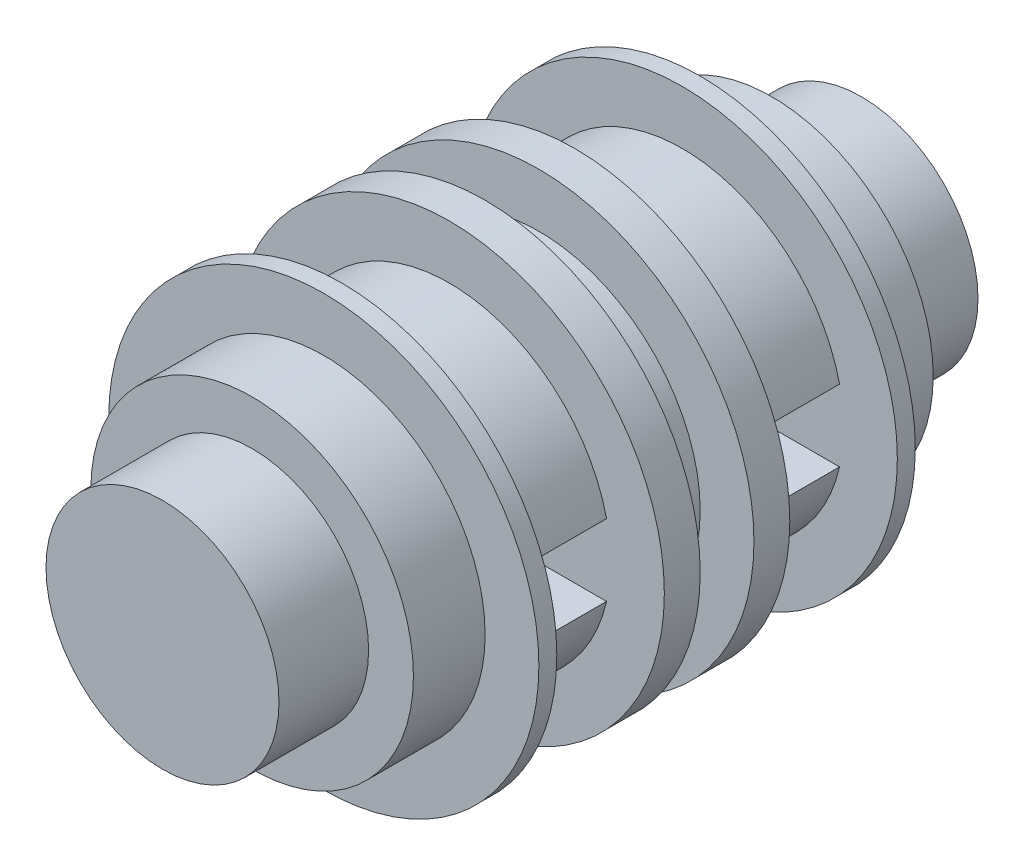
ISO-10303-21;
HEADER;
FILE_DESCRIPTION(('STEP AP214'),'2;1');
FILE_NAME('part.step','',(''),(''),'','','');
FILE_SCHEMA(('AUTOMOTIVE_DESIGN { 1 0 10303 214 1 1 1 1 }'));
ENDSEC;
DATA;
#1=APPLICATION_CONTEXT('core data for automotive mechanical design processes');
#2=APPLICATION_PROTOCOL_DEFINITION('international standard','automotive_design',2000,#1);
#3=PRODUCT_CONTEXT('',#1,'mechanical');
#4=PRODUCT('Part','Part','',(#3));
#5=PRODUCT_RELATED_PRODUCT_CATEGORY('part','',(#4));
#6=PRODUCT_DEFINITION_FORMATION('','',#4);
#7=PRODUCT_DEFINITION_CONTEXT('part definition',#1,'design');
#8=PRODUCT_DEFINITION('design','',#6,#7);
#9=PRODUCT_DEFINITION_SHAPE('','',#8);
#10=(LENGTH_UNIT() NAMED_UNIT(*) SI_UNIT(.MILLI.,.METRE.));
#11=(NAMED_UNIT(*) PLANE_ANGLE_UNIT() SI_UNIT($,.RADIAN.));
#12=(NAMED_UNIT(*) SI_UNIT($,.STERADIAN.) SOLID_ANGLE_UNIT());
#13=UNCERTAINTY_MEASURE_WITH_UNIT(LENGTH_MEASURE(1.E-05),#10,'distance_accuracy_value','');
#14=(GEOMETRIC_REPRESENTATION_CONTEXT(3) GLOBAL_UNCERTAINTY_ASSIGNED_CONTEXT((#13)) GLOBAL_UNIT_ASSIGNED_CONTEXT((#10,
#11,#12)) REPRESENTATION_CONTEXT('',''));
#15=CARTESIAN_POINT('',(0.,0.,0.));
#16=DIRECTION('',(0.,0.,1.));
#17=DIRECTION('',(1.,0.,0.));
#18=AXIS2_PLACEMENT_3D('',#15,#16,#17);
#19=CARTESIAN_POINT('',(0.,0.,-6.5));
#20=DIRECTION('',(0.,0.,1.));
#21=DIRECTION('',(1.,0.,0.));
#22=AXIS2_PLACEMENT_3D('',#19,#20,#21);
#23=CYLINDRICAL_SURFACE('',#22,4.5);
#24=CARTESIAN_POINT('',(0.,0.,-6.5));
#25=DIRECTION('',(0.,0.,1.));
#26=DIRECTION('',(1.,0.,0.));
#27=AXIS2_PLACEMENT_3D('',#24,#25,#26);
#28=CIRCLE('',#27,4.5);
#29=CARTESIAN_POINT('',(4.38748219369606,1.,-6.5));
#30=VERTEX_POINT('',#29);
#31=CARTESIAN_POINT('',(-4.38748219369606,1.,-6.5));
#32=VERTEX_POINT('',#31);
#33=EDGE_CURVE('E112',#30,#32,#28,.T.);
#34=ORIENTED_EDGE('',*,*,#33,.T.);
#35=DIRECTION('',(0.,0.,1.));
#36=VECTOR('',#35,1.);
#37=CARTESIAN_POINT('',(-4.38748219369606,1.,-6.5));
#38=LINE('',#37,#36);
#39=CARTESIAN_POINT('',(-4.38748219369606,1.,-3.5));
#40=VERTEX_POINT('',#39);
#41=EDGE_CURVE('E12',#32,#40,#38,.T.);
#42=ORIENTED_EDGE('',*,*,#41,.T.);
#43=CARTESIAN_POINT('',(0.,0.,-3.5));
#44=DIRECTION('',(0.,0.,-1.));
#45=DIRECTION('',(-1.,0.,0.));
#46=AXIS2_PLACEMENT_3D('',#43,#44,#45);
#47=CIRCLE('',#46,4.5);
#48=CARTESIAN_POINT('',(4.38748219369606,1.,-3.5));
#49=VERTEX_POINT('',#48);
#50=EDGE_CURVE('E190',#40,#49,#47,.T.);
#51=ORIENTED_EDGE('',*,*,#50,.T.);
#52=DIRECTION('',(0.,0.,1.));
#53=VECTOR('',#52,1.);
#54=CARTESIAN_POINT('',(4.38748219369606,1.,-6.5));
#55=LINE('',#54,#53);
#56=EDGE_CURVE('E51',#49,#30,#55,.F.);
#57=ORIENTED_EDGE('',*,*,#56,.T.);
#58=EDGE_LOOP('',(#34,#42,#51,#57));
#59=FACE_BOUND('',#58,.T.);
#60=ADVANCED_FACE('F43',(#59),#23,.T.);
#61=CARTESIAN_POINT('',(-4.38748219369606,-1.,-6.5));
#62=VERTEX_POINT('',#61);
#63=CARTESIAN_POINT('',(4.38748219369606,-1.,-6.5));
#64=VERTEX_POINT('',#63);
#65=EDGE_CURVE('E124',#62,#64,#28,.T.);
#66=ORIENTED_EDGE('',*,*,#65,.T.);
#67=DIRECTION('',(0.,0.,1.));
#68=VECTOR('',#67,1.);
#69=CARTESIAN_POINT('',(4.38748219369606,-1.,-6.5));
#70=LINE('',#69,#68);
#71=CARTESIAN_POINT('',(4.38748219369606,-1.,-3.5));
#72=VERTEX_POINT('',#71);
#73=EDGE_CURVE('E217',#64,#72,#70,.T.);
#74=ORIENTED_EDGE('',*,*,#73,.T.);
#75=CARTESIAN_POINT('',(-4.38748219369606,-1.,-3.5));
#76=VERTEX_POINT('',#75);
#77=EDGE_CURVE('E191',#72,#76,#47,.T.);
#78=ORIENTED_EDGE('',*,*,#77,.T.);
#79=DIRECTION('',(0.,0.,1.));
#80=VECTOR('',#79,1.);
#81=CARTESIAN_POINT('',(-4.38748219369606,-1.,-6.5));
#82=LINE('',#81,#80);
#83=EDGE_CURVE('E189',#76,#62,#82,.F.);
#84=ORIENTED_EDGE('',*,*,#83,.T.);
#85=EDGE_LOOP('',(#66,#74,#78,#84));
#86=FACE_BOUND('',#85,.T.);
#87=ADVANCED_FACE('F222',(#86),#23,.T.);
#88=CARTESIAN_POINT('',(0.,0.,3.));
#89=DIRECTION('',(0.,0.,-1.));
#90=DIRECTION('',(-1.,0.,0.));
#91=AXIS2_PLACEMENT_3D('',#88,#89,#90);
#92=CYLINDRICAL_SURFACE('',#91,4.5);
#93=CARTESIAN_POINT('',(0.,0.,3.));
#94=DIRECTION('',(0.,0.,1.));
#95=DIRECTION('',(1.,0.,0.));
#96=AXIS2_PLACEMENT_3D('',#93,#94,#95);
#97=CIRCLE('',#96,4.5);
#98=CARTESIAN_POINT('',(4.38748219369606,1.,3.));
#99=VERTEX_POINT('',#98);
#100=CARTESIAN_POINT('',(-4.38748219369606,1.,3.));
#101=VERTEX_POINT('',#100);
#102=EDGE_CURVE('E136',#99,#101,#97,.T.);
#103=ORIENTED_EDGE('',*,*,#102,.F.);
#104=DIRECTION('',(0.,0.,-1.));
#105=VECTOR('',#104,1.);
#106=CARTESIAN_POINT('',(4.38748219369606,1.,3.));
#107=LINE('',#106,#105);
#108=CARTESIAN_POINT('',(4.38748219369606,1.,0.));
#109=VERTEX_POINT('',#108);
#110=EDGE_CURVE('E167',#99,#109,#107,.T.);
#111=ORIENTED_EDGE('',*,*,#110,.T.);
#112=CARTESIAN_POINT('',(0.,0.,0.));
#113=DIRECTION('',(0.,0.,1.));
#114=DIRECTION('',(1.,0.,0.));
#115=AXIS2_PLACEMENT_3D('',#112,#113,#114);
#116=CIRCLE('',#115,4.5);
#117=CARTESIAN_POINT('',(-4.38748219369606,1.,0.));
#118=VERTEX_POINT('',#117);
#119=EDGE_CURVE('E206',#109,#118,#116,.T.);
#120=ORIENTED_EDGE('',*,*,#119,.T.);
#121=DIRECTION('',(0.,0.,-1.));
#122=VECTOR('',#121,1.);
#123=CARTESIAN_POINT('',(-4.38748219369606,1.,3.));
#124=LINE('',#123,#122);
#125=EDGE_CURVE('E164',#118,#101,#124,.F.);
#126=ORIENTED_EDGE('',*,*,#125,.T.);
#127=EDGE_LOOP('',(#103,#111,#120,#126));
#128=FACE_BOUND('',#127,.T.);
#129=ADVANCED_FACE('F249',(#128),#92,.T.);
#130=CARTESIAN_POINT('',(-4.38748219369606,-1.,3.));
#131=VERTEX_POINT('',#130);
#132=CARTESIAN_POINT('',(4.38748219369606,-1.,3.));
#133=VERTEX_POINT('',#132);
#134=EDGE_CURVE('E140',#131,#133,#97,.T.);
#135=ORIENTED_EDGE('',*,*,#134,.F.);
#136=DIRECTION('',(0.,0.,-1.));
#137=VECTOR('',#136,1.);
#138=CARTESIAN_POINT('',(-4.38748219369606,-1.,3.));
#139=LINE('',#138,#137);
#140=CARTESIAN_POINT('',(-4.38748219369606,-1.,0.));
#141=VERTEX_POINT('',#140);
#142=EDGE_CURVE('E162',#131,#141,#139,.T.);
#143=ORIENTED_EDGE('',*,*,#142,.T.);
#144=CARTESIAN_POINT('',(4.38748219369606,-1.,0.));
#145=VERTEX_POINT('',#144);
#146=EDGE_CURVE('E210',#141,#145,#116,.T.);
#147=ORIENTED_EDGE('',*,*,#146,.T.);
#148=DIRECTION('',(0.,0.,-1.));
#149=VECTOR('',#148,1.);
#150=CARTESIAN_POINT('',(4.38748219369606,-1.,3.));
#151=LINE('',#150,#149);
#152=EDGE_CURVE('E115',#145,#133,#151,.F.);
#153=ORIENTED_EDGE('',*,*,#152,.T.);
#154=EDGE_LOOP('',(#135,#143,#147,#153));
#155=FACE_BOUND('',#154,.T.);
#156=ADVANCED_FACE('F280',(#155),#92,.T.);
#157=CARTESIAN_POINT('',(0.,0.,-1.));
#158=DIRECTION('',(0.,0.,1.));
#159=DIRECTION('',(1.,0.,0.));
#160=AXIS2_PLACEMENT_3D('',#157,#158,#159);
#161=CYLINDRICAL_SURFACE('',#160,6.);
#162=CARTESIAN_POINT('',(0.,0.,-1.));
#163=DIRECTION('',(0.,0.,-1.));
#164=DIRECTION('',(-1.,0.,0.));
#165=AXIS2_PLACEMENT_3D('',#162,#163,#164);
#166=CIRCLE('',#165,6.);
#167=CARTESIAN_POINT('',(-6.,0.,-1.));
#168=VERTEX_POINT('',#167);
#169=EDGE_CURVE('E207',#168,#168,#166,.T.);
#170=ORIENTED_EDGE('',*,*,#169,.F.);
#171=EDGE_LOOP('',(#170));
#172=FACE_BOUND('',#171,.T.);
#173=CARTESIAN_POINT('',(0.,0.,0.));
#174=DIRECTION('',(0.,0.,-1.));
#175=DIRECTION('',(-1.,0.,0.));
#176=AXIS2_PLACEMENT_3D('',#173,#174,#175);
#177=CIRCLE('',#176,6.);
#178=CARTESIAN_POINT('',(-6.,0.,0.));
#179=VERTEX_POINT('',#178);
#180=EDGE_CURVE('E203',#179,#179,#177,.T.);
#181=ORIENTED_EDGE('',*,*,#180,.T.);
#182=EDGE_LOOP('',(#181));
#183=FACE_BOUND('',#182,.T.);
#184=ADVANCED_FACE('F396',(#172,#183),#161,.T.);
#185=CARTESIAN_POINT('',(0.,0.,-1.));
#186=DIRECTION('',(0.,0.,-1.));
#187=DIRECTION('',(-1.,0.,0.));
#188=AXIS2_PLACEMENT_3D('',#185,#186,#187);
#189=PLANE('',#188);
#190=CARTESIAN_POINT('',(0.,0.,-1.));
#191=DIRECTION('',(0.,0.,-1.));
#192=DIRECTION('',(-1.,0.,0.));
#193=AXIS2_PLACEMENT_3D('',#190,#191,#192);
#194=CIRCLE('',#193,4.5);
#195=CARTESIAN_POINT('',(-4.5,0.,-1.));
#196=VERTEX_POINT('',#195);
#197=EDGE_CURVE('E194',#196,#196,#194,.T.);
#198=ORIENTED_EDGE('',*,*,#197,.F.);
#199=EDGE_LOOP('',(#198));
#200=FACE_BOUND('',#199,.T.);
#201=ORIENTED_EDGE('',*,*,#169,.T.);
#202=EDGE_LOOP('',(#201));
#203=FACE_BOUND('',#202,.T.);
#204=ADVANCED_FACE('F471',(#200,#203),#189,.T.);
#205=CARTESIAN_POINT('',(0.,0.,0.));
#206=DIRECTION('',(0.,0.,-1.));
#207=DIRECTION('',(-1.,0.,0.));
#208=AXIS2_PLACEMENT_3D('',#205,#206,#207);
#209=PLANE('',#208);
#210=ORIENTED_EDGE('',*,*,#119,.F.);
#211=DIRECTION('',(-1.,0.,0.));
#212=VECTOR('',#211,1.);
#213=CARTESIAN_POINT('',(25.45,1.,0.));
#214=LINE('',#213,#212);
#215=EDGE_CURVE('E146',#109,#118,#214,.T.);
#216=ORIENTED_EDGE('',*,*,#215,.T.);
#217=EDGE_LOOP('',(#210,#216));
#218=FACE_BOUND('',#217,.T.);
#219=DIRECTION('',(-1.,0.,0.));
#220=VECTOR('',#219,1.);
#221=CARTESIAN_POINT('',(25.45,-1.,0.));
#222=LINE('',#221,#220);
#223=EDGE_CURVE('E63',#145,#141,#222,.T.);
#224=ORIENTED_EDGE('',*,*,#223,.F.);
#225=ORIENTED_EDGE('',*,*,#146,.F.);
#226=EDGE_LOOP('',(#224,#225));
#227=FACE_BOUND('',#226,.T.);
#228=ORIENTED_EDGE('',*,*,#180,.F.);
#229=EDGE_LOOP('',(#228));
#230=FACE_BOUND('',#229,.T.);
#231=ADVANCED_FACE('F460',(#218,#227,#230),#209,.F.);
#232=CARTESIAN_POINT('',(0.,0.,-2.5));
#233=DIRECTION('',(0.,0.,1.));
#234=DIRECTION('',(1.,0.,0.));
#235=AXIS2_PLACEMENT_3D('',#232,#233,#234);
#236=CYLINDRICAL_SURFACE('',#235,4.5);
#237=CARTESIAN_POINT('',(0.,0.,-2.5));
#238=DIRECTION('',(0.,0.,-1.));
#239=DIRECTION('',(-1.,0.,0.));
#240=AXIS2_PLACEMENT_3D('',#237,#238,#239);
#241=CIRCLE('',#240,4.5);
#242=CARTESIAN_POINT('',(-4.5,0.,-2.5));
#243=VERTEX_POINT('',#242);
#244=EDGE_CURVE('E198',#243,#243,#241,.T.);
#245=ORIENTED_EDGE('',*,*,#244,.F.);
#246=EDGE_LOOP('',(#245));
#247=FACE_BOUND('',#246,.T.);
#248=ORIENTED_EDGE('',*,*,#197,.T.);
#249=EDGE_LOOP('',(#248));
#250=FACE_BOUND('',#249,.T.);
#251=ADVANCED_FACE('F450',(#247,#250),#236,.T.);
#252=CARTESIAN_POINT('',(0.,0.,-3.5));
#253=DIRECTION('',(0.,0.,1.));
#254=DIRECTION('',(1.,0.,0.));
#255=AXIS2_PLACEMENT_3D('',#252,#253,#254);
#256=CYLINDRICAL_SURFACE('',#255,6.);
#257=CARTESIAN_POINT('',(0.,0.,-3.5));
#258=DIRECTION('',(0.,0.,-1.));
#259=DIRECTION('',(-1.,0.,0.));
#260=AXIS2_PLACEMENT_3D('',#257,#258,#259);
#261=CIRCLE('',#260,6.);
#262=CARTESIAN_POINT('',(-6.,0.,-3.5));
#263=VERTEX_POINT('',#262);
#264=EDGE_CURVE('E195',#263,#263,#261,.T.);
#265=ORIENTED_EDGE('',*,*,#264,.F.);
#266=EDGE_LOOP('',(#265));
#267=FACE_BOUND('',#266,.T.);
#268=CARTESIAN_POINT('',(0.,0.,-2.5));
#269=DIRECTION('',(0.,0.,-1.));
#270=DIRECTION('',(-1.,0.,0.));
#271=AXIS2_PLACEMENT_3D('',#268,#269,#270);
#272=CIRCLE('',#271,6.);
#273=CARTESIAN_POINT('',(-6.,0.,-2.5));
#274=VERTEX_POINT('',#273);
#275=EDGE_CURVE('E185',#274,#274,#272,.T.);
#276=ORIENTED_EDGE('',*,*,#275,.T.);
#277=EDGE_LOOP('',(#276));
#278=FACE_BOUND('',#277,.T.);
#279=ADVANCED_FACE('F434',(#267,#278),#256,.T.);
#280=CARTESIAN_POINT('',(0.,0.,-3.5));
#281=DIRECTION('',(0.,0.,-1.));
#282=DIRECTION('',(-1.,0.,0.));
#283=AXIS2_PLACEMENT_3D('',#280,#281,#282);
#284=PLANE('',#283);
#285=ORIENTED_EDGE('',*,*,#50,.F.);
#286=DIRECTION('',(-1.,0.,0.));
#287=VECTOR('',#286,1.);
#288=CARTESIAN_POINT('',(25.45,1.,-3.5));
#289=LINE('',#288,#287);
#290=EDGE_CURVE('E116',#49,#40,#289,.T.);
#291=ORIENTED_EDGE('',*,*,#290,.F.);
#292=EDGE_LOOP('',(#285,#291));
#293=FACE_BOUND('',#292,.T.);
#294=ORIENTED_EDGE('',*,*,#264,.T.);
#295=EDGE_LOOP('',(#294));
#296=FACE_BOUND('',#295,.T.);
#297=ORIENTED_EDGE('',*,*,#77,.F.);
#298=DIRECTION('',(-1.,0.,0.));
#299=VECTOR('',#298,1.);
#300=CARTESIAN_POINT('',(25.45,-1.,-3.5));
#301=LINE('',#300,#299);
#302=EDGE_CURVE('E150',#72,#76,#301,.T.);
#303=ORIENTED_EDGE('',*,*,#302,.T.);
#304=EDGE_LOOP('',(#297,#303));
#305=FACE_BOUND('',#304,.T.);
#306=ADVANCED_FACE('F227',(#293,#296,#305),#284,.T.);
#307=CARTESIAN_POINT('',(0.,0.,-2.5));
#308=DIRECTION('',(0.,0.,-1.));
#309=DIRECTION('',(-1.,0.,0.));
#310=AXIS2_PLACEMENT_3D('',#307,#308,#309);
#311=PLANE('',#310);
#312=ORIENTED_EDGE('',*,*,#244,.T.);
#313=EDGE_LOOP('',(#312));
#314=FACE_BOUND('',#313,.T.);
#315=ORIENTED_EDGE('',*,*,#275,.F.);
#316=EDGE_LOOP('',(#315));
#317=FACE_BOUND('',#316,.T.);
#318=ADVANCED_FACE('F231',(#314,#317),#311,.F.);
#319=CARTESIAN_POINT('',(25.45,-1.,-6.5));
#320=DIRECTION('',(0.,0.,-1.));
#321=DIRECTION('',(-1.,0.,0.));
#322=AXIS2_PLACEMENT_3D('',#319,#320,#321);
#323=PLANE('',#322);
#324=DIRECTION('',(-1.,0.,0.));
#325=VECTOR('',#324,1.);
#326=CARTESIAN_POINT('',(25.45,-1.,-6.5));
#327=LINE('',#326,#325);
#328=EDGE_CURVE('E153',#64,#62,#327,.T.);
#329=ORIENTED_EDGE('',*,*,#328,.F.);
#330=ORIENTED_EDGE('',*,*,#65,.F.);
#331=EDGE_LOOP('',(#329,#330));
#332=FACE_BOUND('',#331,.T.);
#333=DIRECTION('',(-1.,0.,0.));
#334=VECTOR('',#333,1.);
#335=CARTESIAN_POINT('',(25.45,1.,-6.5));
#336=LINE('',#335,#334);
#337=EDGE_CURVE('E107',#30,#32,#336,.T.);
#338=ORIENTED_EDGE('',*,*,#337,.T.);
#339=ORIENTED_EDGE('',*,*,#33,.F.);
#340=EDGE_LOOP('',(#338,#339));
#341=FACE_BOUND('',#340,.T.);
#342=CARTESIAN_POINT('',(0.,0.,-6.5));
#343=DIRECTION('',(0.,0.,1.));
#344=DIRECTION('',(1.,0.,0.));
#345=AXIS2_PLACEMENT_3D('',#342,#343,#344);
#346=CIRCLE('',#345,6.);
#347=CARTESIAN_POINT('',(6.,0.,-6.5));
#348=VERTEX_POINT('',#347);
#349=EDGE_CURVE('E127',#348,#348,#346,.T.);
#350=ORIENTED_EDGE('',*,*,#349,.T.);
#351=EDGE_LOOP('',(#350));
#352=FACE_BOUND('',#351,.T.);
#353=ADVANCED_FACE('F109',(#332,#341,#352),#323,.F.);
#354=CARTESIAN_POINT('',(25.45,1.,-6.5));
#355=DIRECTION('',(0.,1.,0.));
#356=DIRECTION('',(0.,0.,1.));
#357=AXIS2_PLACEMENT_3D('',#354,#355,#356);
#358=PLANE('',#357);
#359=ORIENTED_EDGE('',*,*,#337,.F.);
#360=ORIENTED_EDGE('',*,*,#56,.F.);
#361=ORIENTED_EDGE('',*,*,#290,.T.);
#362=ORIENTED_EDGE('',*,*,#41,.F.);
#363=EDGE_LOOP('',(#359,#360,#361,#362));
#364=FACE_BOUND('',#363,.T.);
#365=ADVANCED_FACE('F118',(#364),#358,.F.);
#366=CARTESIAN_POINT('',(25.45,-1.,-6.5));
#367=DIRECTION('',(0.,-1.,0.));
#368=DIRECTION('',(0.,0.,-1.));
#369=AXIS2_PLACEMENT_3D('',#366,#367,#368);
#370=PLANE('',#369);
#371=ORIENTED_EDGE('',*,*,#328,.T.);
#372=ORIENTED_EDGE('',*,*,#83,.F.);
#373=ORIENTED_EDGE('',*,*,#302,.F.);
#374=ORIENTED_EDGE('',*,*,#73,.F.);
#375=EDGE_LOOP('',(#371,#372,#373,#374));
#376=FACE_BOUND('',#375,.T.);
#377=ADVANCED_FACE('F228',(#376),#370,.F.);
#378=CARTESIAN_POINT('',(25.45,-1.,3.));
#379=DIRECTION('',(0.,0.,1.));
#380=DIRECTION('',(1.,0.,0.));
#381=AXIS2_PLACEMENT_3D('',#378,#379,#380);
#382=PLANE('',#381);
#383=DIRECTION('',(-1.,0.,0.));
#384=VECTOR('',#383,1.);
#385=CARTESIAN_POINT('',(25.45,-1.,3.));
#386=LINE('',#385,#384);
#387=EDGE_CURVE('E58',#133,#131,#386,.T.);
#388=ORIENTED_EDGE('',*,*,#387,.T.);
#389=ORIENTED_EDGE('',*,*,#134,.T.);
#390=EDGE_LOOP('',(#388,#389));
#391=FACE_BOUND('',#390,.T.);
#392=DIRECTION('',(-1.,0.,0.));
#393=VECTOR('',#392,1.);
#394=CARTESIAN_POINT('',(25.45,1.,3.));
#395=LINE('',#394,#393);
#396=EDGE_CURVE('E157',#99,#101,#395,.T.);
#397=ORIENTED_EDGE('',*,*,#396,.F.);
#398=ORIENTED_EDGE('',*,*,#102,.T.);
#399=EDGE_LOOP('',(#397,#398));
#400=FACE_BOUND('',#399,.T.);
#401=CARTESIAN_POINT('',(0.,0.,3.));
#402=DIRECTION('',(0.,0.,1.));
#403=DIRECTION('',(1.,0.,0.));
#404=AXIS2_PLACEMENT_3D('',#401,#402,#403);
#405=CIRCLE('',#404,6.);
#406=CARTESIAN_POINT('',(6.,0.,3.));
#407=VERTEX_POINT('',#406);
#408=EDGE_CURVE('E143',#407,#407,#405,.T.);
#409=ORIENTED_EDGE('',*,*,#408,.F.);
#410=EDGE_LOOP('',(#409));
#411=FACE_BOUND('',#410,.T.);
#412=ADVANCED_FACE('F292',(#391,#400,#411),#382,.F.);
#413=CARTESIAN_POINT('',(25.45,1.,0.));
#414=DIRECTION('',(0.,1.,0.));
#415=DIRECTION('',(0.,0.,1.));
#416=AXIS2_PLACEMENT_3D('',#413,#414,#415);
#417=PLANE('',#416);
#418=ORIENTED_EDGE('',*,*,#396,.T.);
#419=ORIENTED_EDGE('',*,*,#125,.F.);
#420=ORIENTED_EDGE('',*,*,#215,.F.);
#421=ORIENTED_EDGE('',*,*,#110,.F.);
#422=EDGE_LOOP('',(#418,#419,#420,#421));
#423=FACE_BOUND('',#422,.T.);
#424=ADVANCED_FACE('F296',(#423),#417,.F.);
#425=CARTESIAN_POINT('',(25.45,-1.,0.));
#426=DIRECTION('',(0.,-1.,0.));
#427=DIRECTION('',(0.,0.,-1.));
#428=AXIS2_PLACEMENT_3D('',#425,#426,#427);
#429=PLANE('',#428);
#430=ORIENTED_EDGE('',*,*,#387,.F.);
#431=ORIENTED_EDGE('',*,*,#152,.F.);
#432=ORIENTED_EDGE('',*,*,#223,.T.);
#433=ORIENTED_EDGE('',*,*,#142,.F.);
#434=EDGE_LOOP('',(#430,#431,#432,#433));
#435=FACE_BOUND('',#434,.T.);
#436=ADVANCED_FACE('F290',(#435),#429,.F.);
#437=CARTESIAN_POINT('',(0.,0.,3.));
#438=DIRECTION('',(0.,0.,1.));
#439=DIRECTION('',(1.,0.,0.));
#440=AXIS2_PLACEMENT_3D('',#437,#438,#439);
#441=CYLINDRICAL_SURFACE('',#440,6.);
#442=ORIENTED_EDGE('',*,*,#408,.T.);
#443=EDGE_LOOP('',(#442));
#444=FACE_BOUND('',#443,.T.);
#445=CARTESIAN_POINT('',(0.,0.,3.5));
#446=DIRECTION('',(0.,0.,1.));
#447=DIRECTION('',(1.,0.,0.));
#448=AXIS2_PLACEMENT_3D('',#445,#446,#447);
#449=CIRCLE('',#448,6.);
#450=CARTESIAN_POINT('',(6.,0.,3.5));
#451=VERTEX_POINT('',#450);
#452=EDGE_CURVE('E139',#451,#451,#449,.T.);
#453=ORIENTED_EDGE('',*,*,#452,.F.);
#454=EDGE_LOOP('',(#453));
#455=FACE_BOUND('',#454,.T.);
#456=ADVANCED_FACE('F287',(#444,#455),#441,.T.);
#457=CARTESIAN_POINT('',(0.,0.,3.5));
#458=DIRECTION('',(0.,0.,1.));
#459=DIRECTION('',(1.,0.,0.));
#460=AXIS2_PLACEMENT_3D('',#457,#458,#459);
#461=PLANE('',#460);
#462=CARTESIAN_POINT('',(0.,0.,3.5));
#463=DIRECTION('',(0.,0.,1.));
#464=DIRECTION('',(1.,0.,0.));
#465=AXIS2_PLACEMENT_3D('',#462,#463,#464);
#466=CIRCLE('',#465,4.5);
#467=CARTESIAN_POINT('',(4.5,0.,3.5));
#468=VERTEX_POINT('',#467);
#469=EDGE_CURVE('E134',#468,#468,#466,.T.);
#470=ORIENTED_EDGE('',*,*,#469,.F.);
#471=EDGE_LOOP('',(#470));
#472=FACE_BOUND('',#471,.T.);
#473=ORIENTED_EDGE('',*,*,#452,.T.);
#474=EDGE_LOOP('',(#473));
#475=FACE_BOUND('',#474,.T.);
#476=ADVANCED_FACE('F283',(#472,#475),#461,.T.);
#477=CARTESIAN_POINT('',(0.,0.,8.));
#478=DIRECTION('',(0.,0.,1.));
#479=DIRECTION('',(1.,0.,0.));
#480=AXIS2_PLACEMENT_3D('',#477,#478,#479);
#481=PLANE('',#480);
#482=CARTESIAN_POINT('',(0.,0.,8.));
#483=DIRECTION('',(0.,0.,1.));
#484=DIRECTION('',(1.,0.,0.));
#485=AXIS2_PLACEMENT_3D('',#482,#483,#484);
#486=CIRCLE('',#485,3.25);
#487=CARTESIAN_POINT('',(3.25,0.,8.));
#488=VERTEX_POINT('',#487);
#489=EDGE_CURVE('E180',#488,#488,#486,.T.);
#490=ORIENTED_EDGE('',*,*,#489,.T.);
#491=EDGE_LOOP('',(#490));
#492=FACE_BOUND('',#491,.T.);
#493=ADVANCED_FACE('F286',(#492),#481,.T.);
#494=CARTESIAN_POINT('',(0.,0.,8.));
#495=DIRECTION('',(0.,0.,-1.));
#496=DIRECTION('',(-1.,0.,0.));
#497=AXIS2_PLACEMENT_3D('',#494,#495,#496);
#498=CYLINDRICAL_SURFACE('',#497,3.25);
#499=ORIENTED_EDGE('',*,*,#489,.F.);
#500=EDGE_LOOP('',(#499));
#501=FACE_BOUND('',#500,.T.);
#502=CARTESIAN_POINT('',(0.,0.,5.5));
#503=DIRECTION('',(0.,0.,1.));
#504=DIRECTION('',(1.,0.,0.));
#505=AXIS2_PLACEMENT_3D('',#502,#503,#504);
#506=CIRCLE('',#505,3.25);
#507=CARTESIAN_POINT('',(3.25,0.,5.5));
#508=VERTEX_POINT('',#507);
#509=EDGE_CURVE('E186',#508,#508,#506,.T.);
#510=ORIENTED_EDGE('',*,*,#509,.T.);
#511=EDGE_LOOP('',(#510));
#512=FACE_BOUND('',#511,.T.);
#513=ADVANCED_FACE('F315',(#501,#512),#498,.T.);
#514=CARTESIAN_POINT('',(0.,0.,5.5));
#515=DIRECTION('',(0.,0.,1.));
#516=DIRECTION('',(1.,0.,0.));
#517=AXIS2_PLACEMENT_3D('',#514,#515,#516);
#518=PLANE('',#517);
#519=ORIENTED_EDGE('',*,*,#509,.F.);
#520=EDGE_LOOP('',(#519));
#521=FACE_BOUND('',#520,.T.);
#522=CARTESIAN_POINT('',(0.,0.,5.5));
#523=DIRECTION('',(0.,0.,1.));
#524=DIRECTION('',(1.,0.,0.));
#525=AXIS2_PLACEMENT_3D('',#522,#523,#524);
#526=CIRCLE('',#525,4.5);
#527=CARTESIAN_POINT('',(4.5,0.,5.5));
#528=VERTEX_POINT('',#527);
#529=EDGE_CURVE('E173',#528,#528,#526,.T.);
#530=ORIENTED_EDGE('',*,*,#529,.T.);
#531=EDGE_LOOP('',(#530));
#532=FACE_BOUND('',#531,.T.);
#533=ADVANCED_FACE('F278',(#521,#532),#518,.T.);
#534=ORIENTED_EDGE('',*,*,#469,.T.);
#535=EDGE_LOOP('',(#534));
#536=FACE_BOUND('',#535,.T.);
#537=ORIENTED_EDGE('',*,*,#529,.F.);
#538=EDGE_LOOP('',(#537));
#539=FACE_BOUND('',#538,.T.);
#540=ADVANCED_FACE('F45',(#536,#539),#92,.T.);
#541=CARTESIAN_POINT('',(0.,0.,-7.));
#542=DIRECTION('',(0.,0.,-1.));
#543=DIRECTION('',(1.,0.,0.));
#544=AXIS2_PLACEMENT_3D('',#541,#542,#543);
#545=PLANE('',#544);
#546=CARTESIAN_POINT('',(0.,0.,-7.));
#547=DIRECTION('',(0.,0.,1.));
#548=DIRECTION('',(1.,0.,0.));
#549=AXIS2_PLACEMENT_3D('',#546,#547,#548);
#550=CIRCLE('',#549,6.);
#551=CARTESIAN_POINT('',(6.,0.,-7.));
#552=VERTEX_POINT('',#551);
#553=EDGE_CURVE('E123',#552,#552,#550,.T.);
#554=ORIENTED_EDGE('',*,*,#553,.F.);
#555=EDGE_LOOP('',(#554));
#556=FACE_BOUND('',#555,.T.);
#557=CARTESIAN_POINT('',(0.,0.,-7.));
#558=DIRECTION('',(0.,0.,1.));
#559=DIRECTION('',(1.,0.,0.));
#560=AXIS2_PLACEMENT_3D('',#557,#558,#559);
#561=CIRCLE('',#560,4.5);
#562=CARTESIAN_POINT('',(4.5,0.,-7.));
#563=VERTEX_POINT('',#562);
#564=EDGE_CURVE('E129',#563,#563,#561,.T.);
#565=ORIENTED_EDGE('',*,*,#564,.T.);
#566=EDGE_LOOP('',(#565));
#567=FACE_BOUND('',#566,.T.);
#568=ADVANCED_FACE('F267',(#556,#567),#545,.T.);
#569=CARTESIAN_POINT('',(0.,0.,-6.5));
#570=DIRECTION('',(0.,0.,-1.));
#571=DIRECTION('',(-1.,0.,0.));
#572=AXIS2_PLACEMENT_3D('',#569,#570,#571);
#573=CYLINDRICAL_SURFACE('',#572,6.);
#574=ORIENTED_EDGE('',*,*,#349,.F.);
#575=EDGE_LOOP('',(#574));
#576=FACE_BOUND('',#575,.T.);
#577=ORIENTED_EDGE('',*,*,#553,.T.);
#578=EDGE_LOOP('',(#577));
#579=FACE_BOUND('',#578,.T.);
#580=ADVANCED_FACE('F269',(#576,#579),#573,.T.);
#581=CARTESIAN_POINT('',(0.,0.,-11.5));
#582=DIRECTION('',(0.,0.,-1.));
#583=DIRECTION('',(1.,0.,0.));
#584=AXIS2_PLACEMENT_3D('',#581,#582,#583);
#585=PLANE('',#584);
#586=CARTESIAN_POINT('',(0.,0.,-11.5));
#587=DIRECTION('',(0.,0.,1.));
#588=DIRECTION('',(1.,0.,0.));
#589=AXIS2_PLACEMENT_3D('',#586,#587,#588);
#590=CIRCLE('',#589,3.25);
#591=CARTESIAN_POINT('',(3.25,0.,-11.5));
#592=VERTEX_POINT('',#591);
#593=EDGE_CURVE('E177',#592,#592,#590,.T.);
#594=ORIENTED_EDGE('',*,*,#593,.F.);
#595=EDGE_LOOP('',(#594));
#596=FACE_BOUND('',#595,.T.);
#597=ADVANCED_FACE('F275',(#596),#585,.T.);
#598=CARTESIAN_POINT('',(0.,0.,-11.5));
#599=DIRECTION('',(0.,0.,1.));
#600=DIRECTION('',(1.,0.,0.));
#601=AXIS2_PLACEMENT_3D('',#598,#599,#600);
#602=CYLINDRICAL_SURFACE('',#601,3.25);
#603=ORIENTED_EDGE('',*,*,#593,.T.);
#604=EDGE_LOOP('',(#603));
#605=FACE_BOUND('',#604,.T.);
#606=CARTESIAN_POINT('',(0.,0.,-9.));
#607=DIRECTION('',(0.,0.,1.));
#608=DIRECTION('',(1.,0.,0.));
#609=AXIS2_PLACEMENT_3D('',#606,#607,#608);
#610=CIRCLE('',#609,3.25);
#611=CARTESIAN_POINT('',(3.25,0.,-9.));
#612=VERTEX_POINT('',#611);
#613=EDGE_CURVE('E176',#612,#612,#610,.T.);
#614=ORIENTED_EDGE('',*,*,#613,.F.);
#615=EDGE_LOOP('',(#614));
#616=FACE_BOUND('',#615,.T.);
#617=ADVANCED_FACE('F259',(#605,#616),#602,.T.);
#618=CARTESIAN_POINT('',(0.,0.,-9.));
#619=DIRECTION('',(0.,0.,-1.));
#620=DIRECTION('',(1.,0.,0.));
#621=AXIS2_PLACEMENT_3D('',#618,#619,#620);
#622=PLANE('',#621);
#623=ORIENTED_EDGE('',*,*,#613,.T.);
#624=EDGE_LOOP('',(#623));
#625=FACE_BOUND('',#624,.T.);
#626=CARTESIAN_POINT('',(0.,0.,-9.));
#627=DIRECTION('',(0.,0.,-1.));
#628=DIRECTION('',(-1.,0.,0.));
#629=AXIS2_PLACEMENT_3D('',#626,#627,#628);
#630=CIRCLE('',#629,4.5);
#631=CARTESIAN_POINT('',(-4.5,0.,-9.));
#632=VERTEX_POINT('',#631);
#633=EDGE_CURVE('E170',#632,#632,#630,.T.);
#634=ORIENTED_EDGE('',*,*,#633,.T.);
#635=EDGE_LOOP('',(#634));
#636=FACE_BOUND('',#635,.T.);
#637=ADVANCED_FACE('F253',(#625,#636),#622,.T.);
#638=ORIENTED_EDGE('',*,*,#564,.F.);
#639=EDGE_LOOP('',(#638));
#640=FACE_BOUND('',#639,.T.);
#641=ORIENTED_EDGE('',*,*,#633,.F.);
#642=EDGE_LOOP('',(#641));
#643=FACE_BOUND('',#642,.T.);
#644=ADVANCED_FACE('F245',(#640,#643),#23,.T.);
#645=CLOSED_SHELL('',(#60,#87,#129,#156,#184,#204,#231,#251,#279,#306,#318,#353,#365,#377,#412,
#424,#436,#456,#476,#493,#513,#533,#540,#568,#580,#597,#617,#637,#644));
#646=MANIFOLD_SOLID_BREP('B2',#645);
#647=ADVANCED_BREP_SHAPE_REPRESENTATION('',(#18,#646),#14);
#648=SHAPE_DEFINITION_REPRESENTATION(#9,#647);
ENDSEC;
END-ISO-10303-21;
